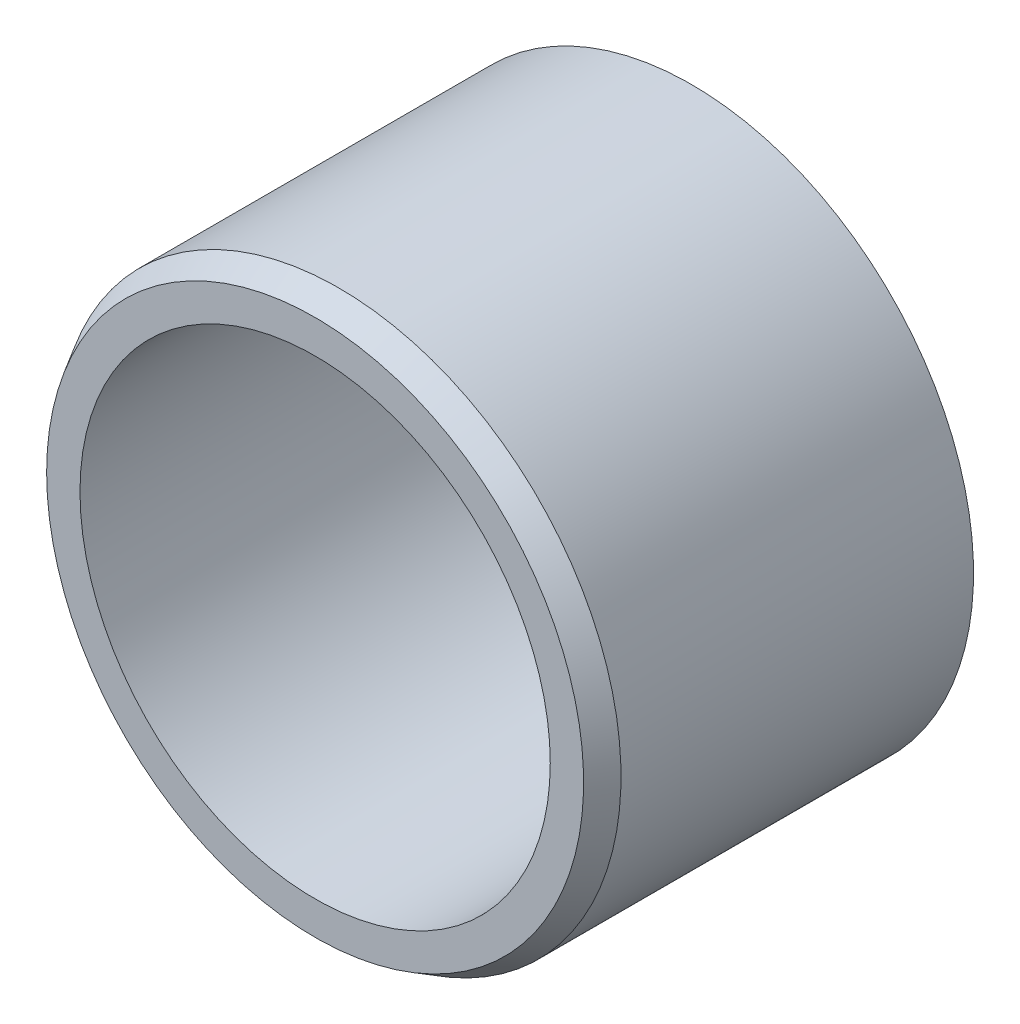
ISO-10303-21;
HEADER;
FILE_DESCRIPTION(('STEP AP214'),'2;1');
FILE_NAME('part.step','',(''),(''),'','','');
FILE_SCHEMA(('AUTOMOTIVE_DESIGN { 1 0 10303 214 1 1 1 1 }'));
ENDSEC;
DATA;
#1=APPLICATION_CONTEXT('core data for automotive mechanical design processes');
#2=APPLICATION_PROTOCOL_DEFINITION('international standard','automotive_design',2000,#1);
#3=PRODUCT_CONTEXT('',#1,'mechanical');
#4=PRODUCT('Part','Part','',(#3));
#5=PRODUCT_RELATED_PRODUCT_CATEGORY('part','',(#4));
#6=PRODUCT_DEFINITION_FORMATION('','',#4);
#7=PRODUCT_DEFINITION_CONTEXT('part definition',#1,'design');
#8=PRODUCT_DEFINITION('design','',#6,#7);
#9=PRODUCT_DEFINITION_SHAPE('','',#8);
#10=(LENGTH_UNIT() NAMED_UNIT(*) SI_UNIT(.MILLI.,.METRE.));
#11=(NAMED_UNIT(*) PLANE_ANGLE_UNIT() SI_UNIT($,.RADIAN.));
#12=(NAMED_UNIT(*) SI_UNIT($,.STERADIAN.) SOLID_ANGLE_UNIT());
#13=UNCERTAINTY_MEASURE_WITH_UNIT(LENGTH_MEASURE(1.E-05),#10,'distance_accuracy_value','');
#14=(GEOMETRIC_REPRESENTATION_CONTEXT(3) GLOBAL_UNCERTAINTY_ASSIGNED_CONTEXT((#13)) GLOBAL_UNIT_ASSIGNED_CONTEXT((#10,
#11,#12)) REPRESENTATION_CONTEXT('',''));
#15=CARTESIAN_POINT('',(0.,0.,0.));
#16=DIRECTION('',(0.,0.,1.));
#17=DIRECTION('',(1.,0.,0.));
#18=AXIS2_PLACEMENT_3D('',#15,#16,#17);
#19=CARTESIAN_POINT('',(0.,0.,12.7));
#20=DIRECTION('',(0.,0.,-1.));
#21=DIRECTION('',(-1.,0.,0.));
#22=AXIS2_PLACEMENT_3D('',#19,#20,#21);
#23=CONICAL_SURFACE('',#22,9.0631197846483,0.523598775598299);
#24=CARTESIAN_POINT('',(0.,0.,12.7));
#25=DIRECTION('',(0.,0.,-1.));
#26=DIRECTION('',(-1.,0.,0.));
#27=AXIS2_PLACEMENT_3D('',#24,#25,#26);
#28=CIRCLE('',#27,9.0631197846483);
#29=CARTESIAN_POINT('',(-9.0631197846483,0.,12.7));
#30=VERTEX_POINT('',#29);
#31=EDGE_CURVE('E35',#30,#30,#28,.F.);
#32=ORIENTED_EDGE('',*,*,#31,.F.);
#33=EDGE_LOOP('',(#32));
#34=FACE_BOUND('',#33,.T.);
#35=CARTESIAN_POINT('',(0.,0.,11.9));
#36=DIRECTION('',(0.,0.,-1.));
#37=DIRECTION('',(-1.,0.,0.));
#38=AXIS2_PLACEMENT_3D('',#35,#36,#37);
#39=CIRCLE('',#38,9.525);
#40=CARTESIAN_POINT('',(-9.525,0.,11.9));
#41=VERTEX_POINT('',#40);
#42=EDGE_CURVE('E19',#41,#41,#39,.T.);
#43=ORIENTED_EDGE('',*,*,#42,.F.);
#44=EDGE_LOOP('',(#43));
#45=FACE_BOUND('',#44,.T.);
#46=ADVANCED_FACE('F15',(#34,#45),#23,.T.);
#47=CARTESIAN_POINT('',(0.,0.,11.9));
#48=DIRECTION('',(0.,0.,-1.));
#49=DIRECTION('',(-1.,0.,0.));
#50=AXIS2_PLACEMENT_3D('',#47,#48,#49);
#51=CYLINDRICAL_SURFACE('',#50,9.525);
#52=ORIENTED_EDGE('',*,*,#42,.T.);
#53=EDGE_LOOP('',(#52));
#54=FACE_BOUND('',#53,.T.);
#55=CARTESIAN_POINT('',(0.,0.,0.));
#56=DIRECTION('',(0.,0.,-1.));
#57=DIRECTION('',(-1.,0.,0.));
#58=AXIS2_PLACEMENT_3D('',#55,#56,#57);
#59=CIRCLE('',#58,9.525);
#60=CARTESIAN_POINT('',(-9.525,0.,0.));
#61=VERTEX_POINT('',#60);
#62=EDGE_CURVE('E33',#61,#61,#59,.T.);
#63=ORIENTED_EDGE('',*,*,#62,.F.);
#64=EDGE_LOOP('',(#63));
#65=FACE_BOUND('',#64,.T.);
#66=ADVANCED_FACE('F42',(#54,#65),#51,.T.);
#67=CARTESIAN_POINT('',(-9.0631197846483,-9.0631197846483,12.7));
#68=DIRECTION('',(0.,0.,1.));
#69=DIRECTION('',(1.,0.,0.));
#70=AXIS2_PLACEMENT_3D('',#67,#68,#69);
#71=PLANE('',#70);
#72=CARTESIAN_POINT('',(0.,0.,12.7));
#73=DIRECTION('',(0.,0.,1.));
#74=DIRECTION('',(1.,0.,0.));
#75=AXIS2_PLACEMENT_3D('',#72,#73,#74);
#76=CIRCLE('',#75,7.9375);
#77=CARTESIAN_POINT('',(7.9375,0.,12.7));
#78=VERTEX_POINT('',#77);
#79=EDGE_CURVE('E28',#78,#78,#76,.T.);
#80=ORIENTED_EDGE('',*,*,#79,.F.);
#81=EDGE_LOOP('',(#80));
#82=FACE_BOUND('',#81,.T.);
#83=ORIENTED_EDGE('',*,*,#31,.T.);
#84=EDGE_LOOP('',(#83));
#85=FACE_BOUND('',#84,.T.);
#86=ADVANCED_FACE('F52',(#82,#85),#71,.T.);
#87=CARTESIAN_POINT('',(9.525,-9.525,0.));
#88=DIRECTION('',(0.,0.,-1.));
#89=DIRECTION('',(-1.,0.,0.));
#90=AXIS2_PLACEMENT_3D('',#87,#88,#89);
#91=PLANE('',#90);
#92=CARTESIAN_POINT('',(0.,0.,0.));
#93=DIRECTION('',(0.,0.,-1.));
#94=DIRECTION('',(-1.,0.,0.));
#95=AXIS2_PLACEMENT_3D('',#92,#93,#94);
#96=CIRCLE('',#95,8.22617513459481);
#97=CARTESIAN_POINT('',(-8.22617513459481,0.,0.));
#98=VERTEX_POINT('',#97);
#99=EDGE_CURVE('E23',#98,#98,#96,.T.);
#100=ORIENTED_EDGE('',*,*,#99,.F.);
#101=EDGE_LOOP('',(#100));
#102=FACE_BOUND('',#101,.T.);
#103=ORIENTED_EDGE('',*,*,#62,.T.);
#104=EDGE_LOOP('',(#103));
#105=FACE_BOUND('',#104,.T.);
#106=ADVANCED_FACE('F59',(#102,#105),#91,.T.);
#107=CARTESIAN_POINT('',(0.,0.,0.5));
#108=DIRECTION('',(0.,0.,1.));
#109=DIRECTION('',(1.,0.,0.));
#110=AXIS2_PLACEMENT_3D('',#107,#108,#109);
#111=CYLINDRICAL_SURFACE('',#110,7.9375);
#112=CARTESIAN_POINT('',(0.,0.,0.499999999999999));
#113=DIRECTION('',(0.,0.,-1.));
#114=DIRECTION('',(-1.,0.,0.));
#115=AXIS2_PLACEMENT_3D('',#112,#113,#114);
#116=CIRCLE('',#115,7.9375);
#117=CARTESIAN_POINT('',(-7.9375,0.,0.499999999999999));
#118=VERTEX_POINT('',#117);
#119=EDGE_CURVE('E10',#118,#118,#116,.F.);
#120=ORIENTED_EDGE('',*,*,#119,.F.);
#121=EDGE_LOOP('',(#120));
#122=FACE_BOUND('',#121,.T.);
#123=ORIENTED_EDGE('',*,*,#79,.T.);
#124=EDGE_LOOP('',(#123));
#125=FACE_BOUND('',#124,.T.);
#126=ADVANCED_FACE('F55',(#122,#125),#111,.F.);
#127=CARTESIAN_POINT('',(0.,0.,0.));
#128=DIRECTION('',(0.,0.,-1.));
#129=DIRECTION('',(-1.,0.,0.));
#130=AXIS2_PLACEMENT_3D('',#127,#128,#129);
#131=CONICAL_SURFACE('',#130,8.22617513459481,0.523598775598291);
#132=ORIENTED_EDGE('',*,*,#119,.T.);
#133=EDGE_LOOP('',(#132));
#134=FACE_BOUND('',#133,.T.);
#135=ORIENTED_EDGE('',*,*,#99,.T.);
#136=EDGE_LOOP('',(#135));
#137=FACE_BOUND('',#136,.T.);
#138=ADVANCED_FACE('F17',(#134,#137),#131,.F.);
#139=CLOSED_SHELL('',(#46,#66,#86,#106,#126,#138));
#140=MANIFOLD_SOLID_BREP('B1',#139);
#141=ADVANCED_BREP_SHAPE_REPRESENTATION('',(#18,#140),#14);
#142=SHAPE_DEFINITION_REPRESENTATION(#9,#141);
ENDSEC;
END-ISO-10303-21;
